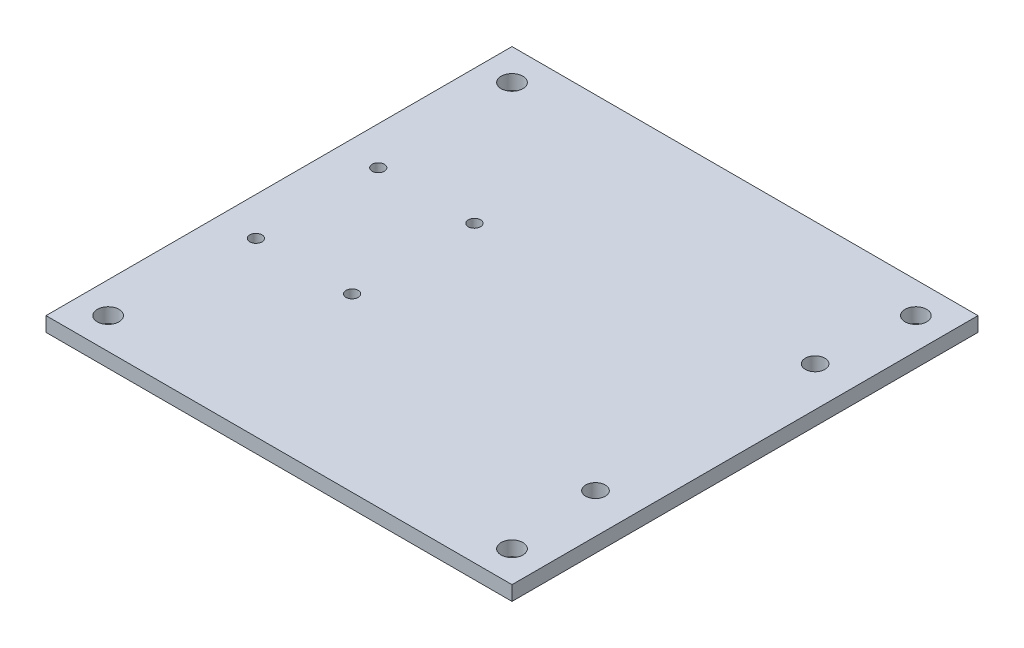
ISO-10303-21;
HEADER;
FILE_DESCRIPTION(('STEP AP214'),'2;1');
FILE_NAME('part.step','',(''),(''),'','','');
FILE_SCHEMA(('AUTOMOTIVE_DESIGN { 1 0 10303 214 1 1 1 1 }'));
ENDSEC;
DATA;
#1=APPLICATION_CONTEXT('core data for automotive mechanical design processes');
#2=APPLICATION_PROTOCOL_DEFINITION('international standard','automotive_design',2000,#1);
#3=PRODUCT_CONTEXT('',#1,'mechanical');
#4=PRODUCT('Part','Part','',(#3));
#5=PRODUCT_RELATED_PRODUCT_CATEGORY('part','',(#4));
#6=PRODUCT_DEFINITION_FORMATION('','',#4);
#7=PRODUCT_DEFINITION_CONTEXT('part definition',#1,'design');
#8=PRODUCT_DEFINITION('design','',#6,#7);
#9=PRODUCT_DEFINITION_SHAPE('','',#8);
#10=(LENGTH_UNIT() NAMED_UNIT(*) SI_UNIT(.MILLI.,.METRE.));
#11=(NAMED_UNIT(*) PLANE_ANGLE_UNIT() SI_UNIT($,.RADIAN.));
#12=(NAMED_UNIT(*) SI_UNIT($,.STERADIAN.) SOLID_ANGLE_UNIT());
#13=UNCERTAINTY_MEASURE_WITH_UNIT(LENGTH_MEASURE(1.E-05),#10,'distance_accuracy_value','');
#14=(GEOMETRIC_REPRESENTATION_CONTEXT(3) GLOBAL_UNCERTAINTY_ASSIGNED_CONTEXT((#13)) GLOBAL_UNIT_ASSIGNED_CONTEXT((#10,
#11,#12)) REPRESENTATION_CONTEXT('',''));
#15=CARTESIAN_POINT('',(0.,0.,0.));
#16=DIRECTION('',(0.,0.,1.));
#17=DIRECTION('',(1.,0.,0.));
#18=AXIS2_PLACEMENT_3D('',#15,#16,#17);
#19=CARTESIAN_POINT('',(0.,4.7625,0.));
#20=DIRECTION('',(0.,-1.,0.));
#21=DIRECTION('',(0.,0.,-1.));
#22=AXIS2_PLACEMENT_3D('',#19,#20,#21);
#23=PLANE('',#22);
#24=DIRECTION('',(1.,0.,0.));
#25=VECTOR('',#24,1.);
#26=CARTESIAN_POINT('',(152.4,4.7625,25.4));
#27=LINE('',#26,#25);
#28=CARTESIAN_POINT('',(0.,4.7625,25.4));
#29=VERTEX_POINT('',#28);
#30=CARTESIAN_POINT('',(152.4,4.7625,25.4));
#31=VERTEX_POINT('',#30);
#32=EDGE_CURVE('E84',#29,#31,#27,.T.);
#33=ORIENTED_EDGE('',*,*,#32,.T.);
#34=DIRECTION('',(0.,0.,-1.));
#35=VECTOR('',#34,1.);
#36=CARTESIAN_POINT('',(152.4,4.7625,-127.));
#37=LINE('',#36,#35);
#38=CARTESIAN_POINT('',(152.4,4.7625,-127.));
#39=VERTEX_POINT('',#38);
#40=EDGE_CURVE('E79',#31,#39,#37,.T.);
#41=ORIENTED_EDGE('',*,*,#40,.T.);
#42=DIRECTION('',(-1.,0.,0.));
#43=VECTOR('',#42,1.);
#44=CARTESIAN_POINT('',(0.,4.7625,-127.));
#45=LINE('',#44,#43);
#46=CARTESIAN_POINT('',(0.,4.7625,-127.));
#47=VERTEX_POINT('',#46);
#48=EDGE_CURVE('E82',#39,#47,#45,.T.);
#49=ORIENTED_EDGE('',*,*,#48,.T.);
#50=DIRECTION('',(0.,0.,1.));
#51=VECTOR('',#50,1.);
#52=CARTESIAN_POINT('',(0.,4.7625,25.4));
#53=LINE('',#52,#51);
#54=EDGE_CURVE('E49',#47,#29,#53,.T.);
#55=ORIENTED_EDGE('',*,*,#54,.T.);
#56=EDGE_LOOP('',(#33,#41,#49,#55));
#57=FACE_BOUND('',#56,.T.);
#58=CARTESIAN_POINT('',(142.24,4.7625,-116.84));
#59=DIRECTION('',(0.,1.,0.));
#60=DIRECTION('',(0.,0.,1.));
#61=AXIS2_PLACEMENT_3D('',#58,#59,#60);
#62=CIRCLE('',#61,3.55600000000001);
#63=CARTESIAN_POINT('',(142.24,4.7625,-113.284));
#64=VERTEX_POINT('',#63);
#65=EDGE_CURVE('E99',#64,#64,#62,.T.);
#66=ORIENTED_EDGE('',*,*,#65,.F.);
#67=EDGE_LOOP('',(#66));
#68=FACE_BOUND('',#67,.T.);
#69=CARTESIAN_POINT('',(10.16,4.7625,-116.84));
#70=DIRECTION('',(0.,1.,0.));
#71=DIRECTION('',(0.,0.,1.));
#72=AXIS2_PLACEMENT_3D('',#69,#70,#71);
#73=CIRCLE('',#72,3.556);
#74=CARTESIAN_POINT('',(10.16,4.7625,-113.284));
#75=VERTEX_POINT('',#74);
#76=EDGE_CURVE('E114',#75,#75,#73,.T.);
#77=ORIENTED_EDGE('',*,*,#76,.F.);
#78=EDGE_LOOP('',(#77));
#79=FACE_BOUND('',#78,.T.);
#80=CARTESIAN_POINT('',(10.16,4.7625,15.24));
#81=DIRECTION('',(0.,1.,0.));
#82=DIRECTION('',(0.,0.,1.));
#83=AXIS2_PLACEMENT_3D('',#80,#81,#82);
#84=CIRCLE('',#83,3.556);
#85=CARTESIAN_POINT('',(10.16,4.7625,18.796));
#86=VERTEX_POINT('',#85);
#87=EDGE_CURVE('E120',#86,#86,#84,.T.);
#88=ORIENTED_EDGE('',*,*,#87,.F.);
#89=EDGE_LOOP('',(#88));
#90=FACE_BOUND('',#89,.T.);
#91=CARTESIAN_POINT('',(142.24,4.7625,15.24));
#92=DIRECTION('',(0.,1.,0.));
#93=DIRECTION('',(0.,0.,1.));
#94=AXIS2_PLACEMENT_3D('',#91,#92,#93);
#95=CIRCLE('',#94,3.55600000000001);
#96=CARTESIAN_POINT('',(142.24,4.7625,18.796));
#97=VERTEX_POINT('',#96);
#98=EDGE_CURVE('E126',#97,#97,#95,.T.);
#99=ORIENTED_EDGE('',*,*,#98,.F.);
#100=EDGE_LOOP('',(#99));
#101=FACE_BOUND('',#100,.T.);
#102=CARTESIAN_POINT('',(139.419367389344,4.7625,-14.8828125));
#103=DIRECTION('',(0.,1.,0.));
#104=DIRECTION('',(0.,0.,1.));
#105=AXIS2_PLACEMENT_3D('',#102,#103,#104);
#106=CIRCLE('',#105,3.2004);
#107=CARTESIAN_POINT('',(139.419367389344,4.7625,-11.6824125));
#108=VERTEX_POINT('',#107);
#109=EDGE_CURVE('E132',#108,#108,#106,.T.);
#110=ORIENTED_EDGE('',*,*,#109,.F.);
#111=EDGE_LOOP('',(#110));
#112=FACE_BOUND('',#111,.T.);
#113=CARTESIAN_POINT('',(139.419367389344,4.7625,-86.7171875));
#114=DIRECTION('',(0.,1.,0.));
#115=DIRECTION('',(0.,0.,1.));
#116=AXIS2_PLACEMENT_3D('',#113,#114,#115);
#117=CIRCLE('',#116,3.2004);
#118=CARTESIAN_POINT('',(139.419367389344,4.7625,-83.5167875));
#119=VERTEX_POINT('',#118);
#120=EDGE_CURVE('E138',#119,#119,#117,.T.);
#121=ORIENTED_EDGE('',*,*,#120,.F.);
#122=EDGE_LOOP('',(#121));
#123=FACE_BOUND('',#122,.T.);
#124=CARTESIAN_POINT('',(12.4515454767842,4.7625,-30.80004));
#125=DIRECTION('',(0.,1.,0.));
#126=DIRECTION('',(0.,0.,1.));
#127=AXIS2_PLACEMENT_3D('',#124,#125,#126);
#128=CIRCLE('',#127,2.);
#129=CARTESIAN_POINT('',(12.4515454767842,4.7625,-28.80004));
#130=VERTEX_POINT('',#129);
#131=EDGE_CURVE('E144',#130,#130,#128,.T.);
#132=ORIENTED_EDGE('',*,*,#131,.F.);
#133=EDGE_LOOP('',(#132));
#134=FACE_BOUND('',#133,.T.);
#135=CARTESIAN_POINT('',(43.9042690278463,4.7625,-30.80004));
#136=DIRECTION('',(0.,1.,0.));
#137=DIRECTION('',(0.,0.,1.));
#138=AXIS2_PLACEMENT_3D('',#135,#136,#137);
#139=CIRCLE('',#138,2.00000000000001);
#140=CARTESIAN_POINT('',(43.9042690278463,4.7625,-28.80004));
#141=VERTEX_POINT('',#140);
#142=EDGE_CURVE('E150',#141,#141,#139,.T.);
#143=ORIENTED_EDGE('',*,*,#142,.F.);
#144=EDGE_LOOP('',(#143));
#145=FACE_BOUND('',#144,.T.);
#146=CARTESIAN_POINT('',(43.9042690278463,4.7625,-70.79996));
#147=DIRECTION('',(0.,1.,0.));
#148=DIRECTION('',(0.,0.,1.));
#149=AXIS2_PLACEMENT_3D('',#146,#147,#148);
#150=CIRCLE('',#149,2.00000000000001);
#151=CARTESIAN_POINT('',(43.9042690278463,4.7625,-68.79996));
#152=VERTEX_POINT('',#151);
#153=EDGE_CURVE('E156',#152,#152,#150,.T.);
#154=ORIENTED_EDGE('',*,*,#153,.F.);
#155=EDGE_LOOP('',(#154));
#156=FACE_BOUND('',#155,.T.);
#157=CARTESIAN_POINT('',(12.4515454767842,4.7625,-70.79996));
#158=DIRECTION('',(0.,1.,0.));
#159=DIRECTION('',(0.,0.,1.));
#160=AXIS2_PLACEMENT_3D('',#157,#158,#159);
#161=CIRCLE('',#160,2.);
#162=CARTESIAN_POINT('',(12.4515454767842,4.7625,-68.79996));
#163=VERTEX_POINT('',#162);
#164=EDGE_CURVE('E162',#163,#163,#161,.T.);
#165=ORIENTED_EDGE('',*,*,#164,.F.);
#166=EDGE_LOOP('',(#165));
#167=FACE_BOUND('',#166,.T.);
#168=ADVANCED_FACE('F32',(#57,#68,#79,#90,#101,#112,#123,#134,#145,#156,#167),#23,.F.);
#169=CARTESIAN_POINT('',(0.,0.,0.));
#170=DIRECTION('',(0.,-1.,0.));
#171=DIRECTION('',(0.,0.,-1.));
#172=AXIS2_PLACEMENT_3D('',#169,#170,#171);
#173=PLANE('',#172);
#174=CARTESIAN_POINT('',(43.9042690278463,0.,-70.79996));
#175=DIRECTION('',(0.,1.,0.));
#176=DIRECTION('',(0.,0.,1.));
#177=AXIS2_PLACEMENT_3D('',#174,#175,#176);
#178=CIRCLE('',#177,2.00000000000001);
#179=CARTESIAN_POINT('',(43.9042690278463,0.,-68.79996));
#180=VERTEX_POINT('',#179);
#181=EDGE_CURVE('E159',#180,#180,#178,.T.);
#182=ORIENTED_EDGE('',*,*,#181,.T.);
#183=EDGE_LOOP('',(#182));
#184=FACE_BOUND('',#183,.T.);
#185=CARTESIAN_POINT('',(12.4515454767842,0.,-30.80004));
#186=DIRECTION('',(0.,1.,0.));
#187=DIRECTION('',(0.,0.,1.));
#188=AXIS2_PLACEMENT_3D('',#185,#186,#187);
#189=CIRCLE('',#188,2.);
#190=CARTESIAN_POINT('',(12.4515454767842,0.,-28.80004));
#191=VERTEX_POINT('',#190);
#192=EDGE_CURVE('E147',#191,#191,#189,.T.);
#193=ORIENTED_EDGE('',*,*,#192,.T.);
#194=EDGE_LOOP('',(#193));
#195=FACE_BOUND('',#194,.T.);
#196=CARTESIAN_POINT('',(139.419367389344,0.,-14.8828125));
#197=DIRECTION('',(0.,1.,0.));
#198=DIRECTION('',(0.,0.,1.));
#199=AXIS2_PLACEMENT_3D('',#196,#197,#198);
#200=CIRCLE('',#199,3.2004);
#201=CARTESIAN_POINT('',(139.419367389344,0.,-11.6824125));
#202=VERTEX_POINT('',#201);
#203=EDGE_CURVE('E135',#202,#202,#200,.T.);
#204=ORIENTED_EDGE('',*,*,#203,.T.);
#205=EDGE_LOOP('',(#204));
#206=FACE_BOUND('',#205,.T.);
#207=CARTESIAN_POINT('',(10.16,0.,15.24));
#208=DIRECTION('',(0.,1.,0.));
#209=DIRECTION('',(0.,0.,1.));
#210=AXIS2_PLACEMENT_3D('',#207,#208,#209);
#211=CIRCLE('',#210,3.556);
#212=CARTESIAN_POINT('',(10.16,0.,18.796));
#213=VERTEX_POINT('',#212);
#214=EDGE_CURVE('E123',#213,#213,#211,.T.);
#215=ORIENTED_EDGE('',*,*,#214,.T.);
#216=EDGE_LOOP('',(#215));
#217=FACE_BOUND('',#216,.T.);
#218=CARTESIAN_POINT('',(142.24,0.,-116.84));
#219=DIRECTION('',(0.,1.,0.));
#220=DIRECTION('',(0.,0.,1.));
#221=AXIS2_PLACEMENT_3D('',#218,#219,#220);
#222=CIRCLE('',#221,3.55600000000001);
#223=CARTESIAN_POINT('',(142.24,0.,-113.284));
#224=VERTEX_POINT('',#223);
#225=EDGE_CURVE('E111',#224,#224,#222,.T.);
#226=ORIENTED_EDGE('',*,*,#225,.T.);
#227=EDGE_LOOP('',(#226));
#228=FACE_BOUND('',#227,.T.);
#229=DIRECTION('',(1.,0.,0.));
#230=VECTOR('',#229,1.);
#231=CARTESIAN_POINT('',(152.4,0.,25.4));
#232=LINE('',#231,#230);
#233=CARTESIAN_POINT('',(0.,0.,25.4));
#234=VERTEX_POINT('',#233);
#235=CARTESIAN_POINT('',(152.4,0.,25.4));
#236=VERTEX_POINT('',#235);
#237=EDGE_CURVE('E96',#234,#236,#232,.T.);
#238=ORIENTED_EDGE('',*,*,#237,.F.);
#239=DIRECTION('',(0.,0.,1.));
#240=VECTOR('',#239,1.);
#241=CARTESIAN_POINT('',(0.,0.,25.4));
#242=LINE('',#241,#240);
#243=CARTESIAN_POINT('',(0.,0.,-127.));
#244=VERTEX_POINT('',#243);
#245=EDGE_CURVE('E72',#244,#234,#242,.T.);
#246=ORIENTED_EDGE('',*,*,#245,.F.);
#247=DIRECTION('',(-1.,0.,0.));
#248=VECTOR('',#247,1.);
#249=CARTESIAN_POINT('',(0.,0.,-127.));
#250=LINE('',#249,#248);
#251=CARTESIAN_POINT('',(152.4,0.,-127.));
#252=VERTEX_POINT('',#251);
#253=EDGE_CURVE('E66',#252,#244,#250,.T.);
#254=ORIENTED_EDGE('',*,*,#253,.F.);
#255=DIRECTION('',(0.,0.,-1.));
#256=VECTOR('',#255,1.);
#257=CARTESIAN_POINT('',(152.4,0.,-127.));
#258=LINE('',#257,#256);
#259=EDGE_CURVE('E88',#236,#252,#258,.T.);
#260=ORIENTED_EDGE('',*,*,#259,.F.);
#261=EDGE_LOOP('',(#238,#246,#254,#260));
#262=FACE_BOUND('',#261,.T.);
#263=CARTESIAN_POINT('',(10.16,0.,-116.84));
#264=DIRECTION('',(0.,1.,0.));
#265=DIRECTION('',(0.,0.,1.));
#266=AXIS2_PLACEMENT_3D('',#263,#264,#265);
#267=CIRCLE('',#266,3.556);
#268=CARTESIAN_POINT('',(10.16,0.,-113.284));
#269=VERTEX_POINT('',#268);
#270=EDGE_CURVE('E117',#269,#269,#267,.T.);
#271=ORIENTED_EDGE('',*,*,#270,.T.);
#272=EDGE_LOOP('',(#271));
#273=FACE_BOUND('',#272,.T.);
#274=CARTESIAN_POINT('',(142.24,0.,15.24));
#275=DIRECTION('',(0.,1.,0.));
#276=DIRECTION('',(0.,0.,1.));
#277=AXIS2_PLACEMENT_3D('',#274,#275,#276);
#278=CIRCLE('',#277,3.55600000000001);
#279=CARTESIAN_POINT('',(142.24,0.,18.796));
#280=VERTEX_POINT('',#279);
#281=EDGE_CURVE('E129',#280,#280,#278,.T.);
#282=ORIENTED_EDGE('',*,*,#281,.T.);
#283=EDGE_LOOP('',(#282));
#284=FACE_BOUND('',#283,.T.);
#285=CARTESIAN_POINT('',(139.419367389344,0.,-86.7171875));
#286=DIRECTION('',(0.,1.,0.));
#287=DIRECTION('',(0.,0.,1.));
#288=AXIS2_PLACEMENT_3D('',#285,#286,#287);
#289=CIRCLE('',#288,3.2004);
#290=CARTESIAN_POINT('',(139.419367389344,0.,-83.5167875));
#291=VERTEX_POINT('',#290);
#292=EDGE_CURVE('E141',#291,#291,#289,.T.);
#293=ORIENTED_EDGE('',*,*,#292,.T.);
#294=EDGE_LOOP('',(#293));
#295=FACE_BOUND('',#294,.T.);
#296=CARTESIAN_POINT('',(43.9042690278463,0.,-30.80004));
#297=DIRECTION('',(0.,1.,0.));
#298=DIRECTION('',(0.,0.,1.));
#299=AXIS2_PLACEMENT_3D('',#296,#297,#298);
#300=CIRCLE('',#299,2.00000000000001);
#301=CARTESIAN_POINT('',(43.9042690278463,0.,-28.80004));
#302=VERTEX_POINT('',#301);
#303=EDGE_CURVE('E153',#302,#302,#300,.T.);
#304=ORIENTED_EDGE('',*,*,#303,.T.);
#305=EDGE_LOOP('',(#304));
#306=FACE_BOUND('',#305,.T.);
#307=CARTESIAN_POINT('',(12.4515454767842,0.,-70.79996));
#308=DIRECTION('',(0.,1.,0.));
#309=DIRECTION('',(0.,0.,1.));
#310=AXIS2_PLACEMENT_3D('',#307,#308,#309);
#311=CIRCLE('',#310,2.);
#312=CARTESIAN_POINT('',(12.4515454767842,0.,-68.79996));
#313=VERTEX_POINT('',#312);
#314=EDGE_CURVE('E165',#313,#313,#311,.T.);
#315=ORIENTED_EDGE('',*,*,#314,.T.);
#316=EDGE_LOOP('',(#315));
#317=FACE_BOUND('',#316,.T.);
#318=ADVANCED_FACE('F107',(#184,#195,#206,#217,#228,#262,#273,#284,#295,#306,#317),#173,.T.);
#319=CARTESIAN_POINT('',(152.4,4.7625,25.4));
#320=DIRECTION('',(0.,0.,-1.));
#321=DIRECTION('',(-1.,0.,0.));
#322=AXIS2_PLACEMENT_3D('',#319,#320,#321);
#323=PLANE('',#322);
#324=ORIENTED_EDGE('',*,*,#237,.T.);
#325=DIRECTION('',(0.,-1.,0.));
#326=VECTOR('',#325,1.);
#327=CARTESIAN_POINT('',(152.4,4.7625,25.4));
#328=LINE('',#327,#326);
#329=EDGE_CURVE('E11',#31,#236,#328,.T.);
#330=ORIENTED_EDGE('',*,*,#329,.F.);
#331=ORIENTED_EDGE('',*,*,#32,.F.);
#332=DIRECTION('',(0.,-1.,0.));
#333=VECTOR('',#332,1.);
#334=CARTESIAN_POINT('',(0.,4.7625,25.4));
#335=LINE('',#334,#333);
#336=EDGE_CURVE('E92',#29,#234,#335,.T.);
#337=ORIENTED_EDGE('',*,*,#336,.T.);
#338=EDGE_LOOP('',(#324,#330,#331,#337));
#339=FACE_BOUND('',#338,.T.);
#340=ADVANCED_FACE('F34',(#339),#323,.F.);
#341=CARTESIAN_POINT('',(152.4,4.7625,-127.));
#342=DIRECTION('',(-1.,0.,0.));
#343=DIRECTION('',(0.,0.,1.));
#344=AXIS2_PLACEMENT_3D('',#341,#342,#343);
#345=PLANE('',#344);
#346=ORIENTED_EDGE('',*,*,#259,.T.);
#347=DIRECTION('',(0.,-1.,0.));
#348=VECTOR('',#347,1.);
#349=CARTESIAN_POINT('',(152.4,4.7625,-127.));
#350=LINE('',#349,#348);
#351=EDGE_CURVE('E41',#39,#252,#350,.T.);
#352=ORIENTED_EDGE('',*,*,#351,.F.);
#353=ORIENTED_EDGE('',*,*,#40,.F.);
#354=ORIENTED_EDGE('',*,*,#329,.T.);
#355=EDGE_LOOP('',(#346,#352,#353,#354));
#356=FACE_BOUND('',#355,.T.);
#357=ADVANCED_FACE('F87',(#356),#345,.F.);
#358=CARTESIAN_POINT('',(0.,4.7625,-127.));
#359=DIRECTION('',(0.,0.,1.));
#360=DIRECTION('',(1.,0.,0.));
#361=AXIS2_PLACEMENT_3D('',#358,#359,#360);
#362=PLANE('',#361);
#363=ORIENTED_EDGE('',*,*,#253,.T.);
#364=DIRECTION('',(0.,-1.,0.));
#365=VECTOR('',#364,1.);
#366=CARTESIAN_POINT('',(0.,4.7625,-127.));
#367=LINE('',#366,#365);
#368=EDGE_CURVE('E89',#47,#244,#367,.T.);
#369=ORIENTED_EDGE('',*,*,#368,.F.);
#370=ORIENTED_EDGE('',*,*,#48,.F.);
#371=ORIENTED_EDGE('',*,*,#351,.T.);
#372=EDGE_LOOP('',(#363,#369,#370,#371));
#373=FACE_BOUND('',#372,.T.);
#374=ADVANCED_FACE('F90',(#373),#362,.F.);
#375=CARTESIAN_POINT('',(0.,4.7625,25.4));
#376=DIRECTION('',(1.,0.,0.));
#377=DIRECTION('',(0.,0.,-1.));
#378=AXIS2_PLACEMENT_3D('',#375,#376,#377);
#379=PLANE('',#378);
#380=ORIENTED_EDGE('',*,*,#245,.T.);
#381=ORIENTED_EDGE('',*,*,#336,.F.);
#382=ORIENTED_EDGE('',*,*,#54,.F.);
#383=ORIENTED_EDGE('',*,*,#368,.T.);
#384=EDGE_LOOP('',(#380,#381,#382,#383));
#385=FACE_BOUND('',#384,.T.);
#386=ADVANCED_FACE('F104',(#385),#379,.F.);
#387=CARTESIAN_POINT('',(142.24,4.7625,-116.84));
#388=DIRECTION('',(0.,-1.,0.));
#389=DIRECTION('',(0.,0.,-1.));
#390=AXIS2_PLACEMENT_3D('',#387,#388,#389);
#391=CYLINDRICAL_SURFACE('',#390,3.55600000000001);
#392=ORIENTED_EDGE('',*,*,#65,.T.);
#393=EDGE_LOOP('',(#392));
#394=FACE_BOUND('',#393,.T.);
#395=ORIENTED_EDGE('',*,*,#225,.F.);
#396=EDGE_LOOP('',(#395));
#397=FACE_BOUND('',#396,.T.);
#398=ADVANCED_FACE('F182',(#394,#397),#391,.F.);
#399=CARTESIAN_POINT('',(10.16,4.7625,-116.84));
#400=DIRECTION('',(0.,-1.,0.));
#401=DIRECTION('',(0.,0.,-1.));
#402=AXIS2_PLACEMENT_3D('',#399,#400,#401);
#403=CYLINDRICAL_SURFACE('',#402,3.556);
#404=ORIENTED_EDGE('',*,*,#76,.T.);
#405=EDGE_LOOP('',(#404));
#406=FACE_BOUND('',#405,.T.);
#407=ORIENTED_EDGE('',*,*,#270,.F.);
#408=EDGE_LOOP('',(#407));
#409=FACE_BOUND('',#408,.T.);
#410=ADVANCED_FACE('F228',(#406,#409),#403,.F.);
#411=CARTESIAN_POINT('',(10.16,4.7625,15.24));
#412=DIRECTION('',(0.,-1.,0.));
#413=DIRECTION('',(0.,0.,-1.));
#414=AXIS2_PLACEMENT_3D('',#411,#412,#413);
#415=CYLINDRICAL_SURFACE('',#414,3.556);
#416=ORIENTED_EDGE('',*,*,#87,.T.);
#417=EDGE_LOOP('',(#416));
#418=FACE_BOUND('',#417,.T.);
#419=ORIENTED_EDGE('',*,*,#214,.F.);
#420=EDGE_LOOP('',(#419));
#421=FACE_BOUND('',#420,.T.);
#422=ADVANCED_FACE('F236',(#418,#421),#415,.F.);
#423=CARTESIAN_POINT('',(142.24,4.7625,15.24));
#424=DIRECTION('',(0.,-1.,0.));
#425=DIRECTION('',(0.,0.,-1.));
#426=AXIS2_PLACEMENT_3D('',#423,#424,#425);
#427=CYLINDRICAL_SURFACE('',#426,3.55600000000001);
#428=ORIENTED_EDGE('',*,*,#98,.T.);
#429=EDGE_LOOP('',(#428));
#430=FACE_BOUND('',#429,.T.);
#431=ORIENTED_EDGE('',*,*,#281,.F.);
#432=EDGE_LOOP('',(#431));
#433=FACE_BOUND('',#432,.T.);
#434=ADVANCED_FACE('F244',(#430,#433),#427,.F.);
#435=CARTESIAN_POINT('',(139.419367389344,4.7625,-14.8828125));
#436=DIRECTION('',(0.,-1.,0.));
#437=DIRECTION('',(0.,0.,-1.));
#438=AXIS2_PLACEMENT_3D('',#435,#436,#437);
#439=CYLINDRICAL_SURFACE('',#438,3.2004);
#440=ORIENTED_EDGE('',*,*,#109,.T.);
#441=EDGE_LOOP('',(#440));
#442=FACE_BOUND('',#441,.T.);
#443=ORIENTED_EDGE('',*,*,#203,.F.);
#444=EDGE_LOOP('',(#443));
#445=FACE_BOUND('',#444,.T.);
#446=ADVANCED_FACE('F253',(#442,#445),#439,.F.);
#447=CARTESIAN_POINT('',(139.419367389344,4.7625,-86.7171875));
#448=DIRECTION('',(0.,-1.,0.));
#449=DIRECTION('',(0.,0.,-1.));
#450=AXIS2_PLACEMENT_3D('',#447,#448,#449);
#451=CYLINDRICAL_SURFACE('',#450,3.2004);
#452=ORIENTED_EDGE('',*,*,#120,.T.);
#453=EDGE_LOOP('',(#452));
#454=FACE_BOUND('',#453,.T.);
#455=ORIENTED_EDGE('',*,*,#292,.F.);
#456=EDGE_LOOP('',(#455));
#457=FACE_BOUND('',#456,.T.);
#458=ADVANCED_FACE('F262',(#454,#457),#451,.F.);
#459=CARTESIAN_POINT('',(12.4515454767842,4.7625,-30.80004));
#460=DIRECTION('',(0.,-1.,0.));
#461=DIRECTION('',(0.,0.,-1.));
#462=AXIS2_PLACEMENT_3D('',#459,#460,#461);
#463=CYLINDRICAL_SURFACE('',#462,2.);
#464=ORIENTED_EDGE('',*,*,#131,.T.);
#465=EDGE_LOOP('',(#464));
#466=FACE_BOUND('',#465,.T.);
#467=ORIENTED_EDGE('',*,*,#192,.F.);
#468=EDGE_LOOP('',(#467));
#469=FACE_BOUND('',#468,.T.);
#470=ADVANCED_FACE('F271',(#466,#469),#463,.F.);
#471=CARTESIAN_POINT('',(43.9042690278463,4.7625,-30.80004));
#472=DIRECTION('',(0.,-1.,0.));
#473=DIRECTION('',(0.,0.,-1.));
#474=AXIS2_PLACEMENT_3D('',#471,#472,#473);
#475=CYLINDRICAL_SURFACE('',#474,2.00000000000001);
#476=ORIENTED_EDGE('',*,*,#142,.T.);
#477=EDGE_LOOP('',(#476));
#478=FACE_BOUND('',#477,.T.);
#479=ORIENTED_EDGE('',*,*,#303,.F.);
#480=EDGE_LOOP('',(#479));
#481=FACE_BOUND('',#480,.T.);
#482=ADVANCED_FACE('F280',(#478,#481),#475,.F.);
#483=CARTESIAN_POINT('',(43.9042690278463,4.7625,-70.79996));
#484=DIRECTION('',(0.,-1.,0.));
#485=DIRECTION('',(0.,0.,-1.));
#486=AXIS2_PLACEMENT_3D('',#483,#484,#485);
#487=CYLINDRICAL_SURFACE('',#486,2.00000000000001);
#488=ORIENTED_EDGE('',*,*,#153,.T.);
#489=EDGE_LOOP('',(#488));
#490=FACE_BOUND('',#489,.T.);
#491=ORIENTED_EDGE('',*,*,#181,.F.);
#492=EDGE_LOOP('',(#491));
#493=FACE_BOUND('',#492,.T.);
#494=ADVANCED_FACE('F289',(#490,#493),#487,.F.);
#495=CARTESIAN_POINT('',(12.4515454767842,4.7625,-70.79996));
#496=DIRECTION('',(0.,-1.,0.));
#497=DIRECTION('',(0.,0.,-1.));
#498=AXIS2_PLACEMENT_3D('',#495,#496,#497);
#499=CYLINDRICAL_SURFACE('',#498,2.);
#500=ORIENTED_EDGE('',*,*,#164,.T.);
#501=EDGE_LOOP('',(#500));
#502=FACE_BOUND('',#501,.T.);
#503=ORIENTED_EDGE('',*,*,#314,.F.);
#504=EDGE_LOOP('',(#503));
#505=FACE_BOUND('',#504,.T.);
#506=ADVANCED_FACE('F171',(#502,#505),#499,.F.);
#507=CLOSED_SHELL('',(#168,#318,#340,#357,#374,#386,#398,#410,#422,#434,#446,#458,#470,#482,
#494,#506));
#508=MANIFOLD_SOLID_BREP('B2',#507);
#509=ADVANCED_BREP_SHAPE_REPRESENTATION('',(#18,#508),#14);
#510=SHAPE_DEFINITION_REPRESENTATION(#9,#509);
ENDSEC;
END-ISO-10303-21;
